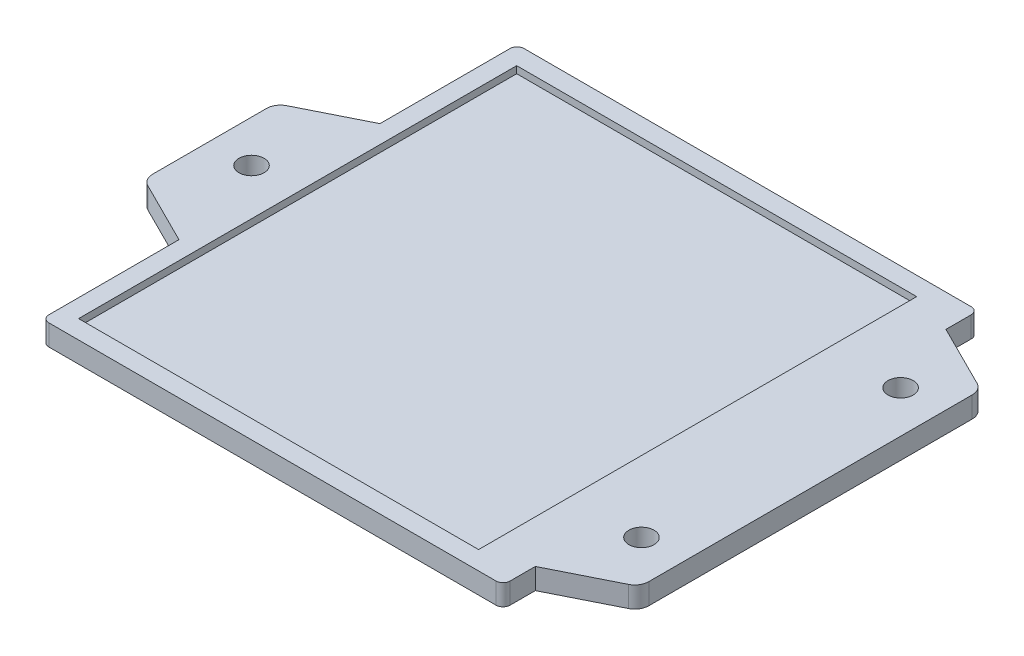
ISO-10303-21;
HEADER;
FILE_DESCRIPTION(('STEP AP214'),'2;1');
FILE_NAME('part.step','',(''),(''),'','','');
FILE_SCHEMA(('AUTOMOTIVE_DESIGN { 1 0 10303 214 1 1 1 1 }'));
ENDSEC;
DATA;
#1=APPLICATION_CONTEXT('core data for automotive mechanical design processes');
#2=APPLICATION_PROTOCOL_DEFINITION('international standard','automotive_design',2000,#1);
#3=PRODUCT_CONTEXT('',#1,'mechanical');
#4=PRODUCT('Part','Part','',(#3));
#5=PRODUCT_RELATED_PRODUCT_CATEGORY('part','',(#4));
#6=PRODUCT_DEFINITION_FORMATION('','',#4);
#7=PRODUCT_DEFINITION_CONTEXT('part definition',#1,'design');
#8=PRODUCT_DEFINITION('design','',#6,#7);
#9=PRODUCT_DEFINITION_SHAPE('','',#8);
#10=(LENGTH_UNIT() NAMED_UNIT(*) SI_UNIT(.MILLI.,.METRE.));
#11=(NAMED_UNIT(*) PLANE_ANGLE_UNIT() SI_UNIT($,.RADIAN.));
#12=(NAMED_UNIT(*) SI_UNIT($,.STERADIAN.) SOLID_ANGLE_UNIT());
#13=UNCERTAINTY_MEASURE_WITH_UNIT(LENGTH_MEASURE(1.E-05),#10,'distance_accuracy_value','');
#14=(GEOMETRIC_REPRESENTATION_CONTEXT(3) GLOBAL_UNCERTAINTY_ASSIGNED_CONTEXT((#13)) GLOBAL_UNIT_ASSIGNED_CONTEXT((#10,
#11,#12)) REPRESENTATION_CONTEXT('',''));
#15=CARTESIAN_POINT('',(0.,0.,0.));
#16=DIRECTION('',(0.,0.,1.));
#17=DIRECTION('',(1.,0.,0.));
#18=AXIS2_PLACEMENT_3D('',#15,#16,#17);
#19=CARTESIAN_POINT('',(32.,3.,33.));
#20=DIRECTION('',(0.,-1.,0.));
#21=DIRECTION('',(0.,0.,-1.));
#22=AXIS2_PLACEMENT_3D('',#19,#20,#21);
#23=PLANE('',#22);
#24=DIRECTION('',(-1.,0.,0.));
#25=VECTOR('',#24,1.);
#26=CARTESIAN_POINT('',(32.,3.,-31.35));
#27=LINE('',#26,#25);
#28=CARTESIAN_POINT('',(26.85,3.,-31.35));
#29=VERTEX_POINT('',#28);
#30=CARTESIAN_POINT('',(-30.4,3.,-31.35));
#31=VERTEX_POINT('',#30);
#32=EDGE_CURVE('E401',#29,#31,#27,.T.);
#33=ORIENTED_EDGE('',*,*,#32,.F.);
#34=DIRECTION('',(0.,0.,-1.));
#35=VECTOR('',#34,1.);
#36=CARTESIAN_POINT('',(26.85,3.,33.));
#37=LINE('',#36,#35);
#38=CARTESIAN_POINT('',(26.85,3.,31.35));
#39=VERTEX_POINT('',#38);
#40=EDGE_CURVE('E48',#39,#29,#37,.T.);
#41=ORIENTED_EDGE('',*,*,#40,.F.);
#42=DIRECTION('',(1.,0.,0.));
#43=VECTOR('',#42,1.);
#44=CARTESIAN_POINT('',(32.,3.,31.35));
#45=LINE('',#44,#43);
#46=CARTESIAN_POINT('',(-30.4,3.,31.35));
#47=VERTEX_POINT('',#46);
#48=EDGE_CURVE('E394',#47,#39,#45,.T.);
#49=ORIENTED_EDGE('',*,*,#48,.F.);
#50=DIRECTION('',(0.,0.,1.));
#51=VECTOR('',#50,1.);
#52=CARTESIAN_POINT('',(-30.4,3.,33.));
#53=LINE('',#52,#51);
#54=EDGE_CURVE('E398',#31,#47,#53,.T.);
#55=ORIENTED_EDGE('',*,*,#54,.F.);
#56=EDGE_LOOP('',(#33,#41,#49,#55));
#57=FACE_BOUND('',#56,.T.);
#58=DIRECTION('',(0.894427190999915,0.,-0.447213595499961));
#59=VECTOR('',#58,1.);
#60=CARTESIAN_POINT('',(41.8944271909999,3.,24.9347524157501));
#61=LINE('',#60,#59);
#62=CARTESIAN_POINT('',(33.,3.,29.3819660112501));
#63=VERTEX_POINT('',#62);
#64=CARTESIAN_POINT('',(41.8944271909999,3.,24.9347524157501));
#65=VERTEX_POINT('',#64);
#66=EDGE_CURVE('E254',#63,#65,#61,.T.);
#67=ORIENTED_EDGE('',*,*,#66,.T.);
#68=CARTESIAN_POINT('',(41.,3.,23.1458980337503));
#69=DIRECTION('',(0.,1.,0.));
#70=DIRECTION('',(0.,0.,-1.));
#71=AXIS2_PLACEMENT_3D('',#68,#69,#70);
#72=CIRCLE('',#71,2.);
#73=CARTESIAN_POINT('',(43.,3.,23.1458980337503));
#74=VERTEX_POINT('',#73);
#75=EDGE_CURVE('E134',#65,#74,#72,.T.);
#76=ORIENTED_EDGE('',*,*,#75,.T.);
#77=DIRECTION('',(0.,0.,-1.));
#78=VECTOR('',#77,1.);
#79=CARTESIAN_POINT('',(43.,3.,-23.1458980337503));
#80=LINE('',#79,#78);
#81=CARTESIAN_POINT('',(43.,3.,-23.1458980337503));
#82=VERTEX_POINT('',#81);
#83=EDGE_CURVE('E305',#74,#82,#80,.T.);
#84=ORIENTED_EDGE('',*,*,#83,.T.);
#85=CARTESIAN_POINT('',(41.,3.,-23.1458980337503));
#86=DIRECTION('',(0.,1.,0.));
#87=DIRECTION('',(0.,0.,-1.));
#88=AXIS2_PLACEMENT_3D('',#85,#86,#87);
#89=CIRCLE('',#88,2.);
#90=CARTESIAN_POINT('',(41.8944271909999,3.,-24.9347524157501));
#91=VERTEX_POINT('',#90);
#92=EDGE_CURVE('E324',#82,#91,#89,.T.);
#93=ORIENTED_EDGE('',*,*,#92,.T.);
#94=DIRECTION('',(-0.894427190999915,0.,-0.44721359549996));
#95=VECTOR('',#94,1.);
#96=CARTESIAN_POINT('',(33.,3.,-29.3819660112501));
#97=LINE('',#96,#95);
#98=CARTESIAN_POINT('',(33.,3.,-29.3819660112501));
#99=VERTEX_POINT('',#98);
#100=EDGE_CURVE('E321',#91,#99,#97,.T.);
#101=ORIENTED_EDGE('',*,*,#100,.T.);
#102=DIRECTION('',(0.,0.,-1.));
#103=VECTOR('',#102,1.);
#104=CARTESIAN_POINT('',(33.,3.,-33.));
#105=LINE('',#104,#103);
#106=CARTESIAN_POINT('',(33.,3.,-33.));
#107=VERTEX_POINT('',#106);
#108=EDGE_CURVE('E323',#99,#107,#105,.T.);
#109=ORIENTED_EDGE('',*,*,#108,.T.);
#110=CARTESIAN_POINT('',(32.,3.,-33.));
#111=DIRECTION('',(0.,1.,0.));
#112=DIRECTION('',(0.,0.,-1.));
#113=AXIS2_PLACEMENT_3D('',#110,#111,#112);
#114=CIRCLE('',#113,1.);
#115=CARTESIAN_POINT('',(32.,3.,-34.));
#116=VERTEX_POINT('',#115);
#117=EDGE_CURVE('E326',#107,#116,#114,.T.);
#118=ORIENTED_EDGE('',*,*,#117,.T.);
#119=DIRECTION('',(-1.,0.,0.));
#120=VECTOR('',#119,1.);
#121=CARTESIAN_POINT('',(-32.,3.,-34.));
#122=LINE('',#121,#120);
#123=CARTESIAN_POINT('',(-32.,3.,-34.));
#124=VERTEX_POINT('',#123);
#125=EDGE_CURVE('E332',#116,#124,#122,.T.);
#126=ORIENTED_EDGE('',*,*,#125,.T.);
#127=CARTESIAN_POINT('',(-32.,3.,-33.));
#128=DIRECTION('',(0.,1.,0.));
#129=DIRECTION('',(0.,0.,-1.));
#130=AXIS2_PLACEMENT_3D('',#127,#128,#129);
#131=CIRCLE('',#130,1.);
#132=CARTESIAN_POINT('',(-33.,3.,-33.));
#133=VERTEX_POINT('',#132);
#134=EDGE_CURVE('E334',#124,#133,#131,.T.);
#135=ORIENTED_EDGE('',*,*,#134,.T.);
#136=DIRECTION('',(0.,0.,1.));
#137=VECTOR('',#136,1.);
#138=CARTESIAN_POINT('',(-33.,3.,-14.3819660112501));
#139=LINE('',#138,#137);
#140=CARTESIAN_POINT('',(-33.,3.,-14.3819660112501));
#141=VERTEX_POINT('',#140);
#142=EDGE_CURVE('E336',#133,#141,#139,.T.);
#143=ORIENTED_EDGE('',*,*,#142,.T.);
#144=DIRECTION('',(-0.894427190999916,0.,0.447213595499959));
#145=VECTOR('',#144,1.);
#146=CARTESIAN_POINT('',(-41.8944271909999,3.,-9.93475241575016));
#147=LINE('',#146,#145);
#148=CARTESIAN_POINT('',(-41.8944271909999,3.,-9.93475241575016));
#149=VERTEX_POINT('',#148);
#150=EDGE_CURVE('E338',#141,#149,#147,.T.);
#151=ORIENTED_EDGE('',*,*,#150,.T.);
#152=CARTESIAN_POINT('',(-41.,3.,-8.14589803375033));
#153=DIRECTION('',(0.,1.,0.));
#154=DIRECTION('',(0.,0.,-1.));
#155=AXIS2_PLACEMENT_3D('',#152,#153,#154);
#156=CIRCLE('',#155,2.);
#157=CARTESIAN_POINT('',(-43.,3.,-8.14589803375032));
#158=VERTEX_POINT('',#157);
#159=EDGE_CURVE('E340',#149,#158,#156,.T.);
#160=ORIENTED_EDGE('',*,*,#159,.T.);
#161=DIRECTION('',(0.,0.,1.));
#162=VECTOR('',#161,1.);
#163=CARTESIAN_POINT('',(-43.,3.,8.14589803375031));
#164=LINE('',#163,#162);
#165=CARTESIAN_POINT('',(-43.,3.,8.14589803375031));
#166=VERTEX_POINT('',#165);
#167=EDGE_CURVE('E342',#158,#166,#164,.T.);
#168=ORIENTED_EDGE('',*,*,#167,.T.);
#169=CARTESIAN_POINT('',(-41.,3.,8.14589803375032));
#170=DIRECTION('',(0.,1.,0.));
#171=DIRECTION('',(0.,0.,-1.));
#172=AXIS2_PLACEMENT_3D('',#169,#170,#171);
#173=CIRCLE('',#172,2.);
#174=CARTESIAN_POINT('',(-41.8944271909999,3.,9.93475241575016));
#175=VERTEX_POINT('',#174);
#176=EDGE_CURVE('E344',#166,#175,#173,.T.);
#177=ORIENTED_EDGE('',*,*,#176,.T.);
#178=DIRECTION('',(0.894427190999915,0.,0.447213595499959));
#179=VECTOR('',#178,1.);
#180=CARTESIAN_POINT('',(-33.,3.,14.3819660112501));
#181=LINE('',#180,#179);
#182=CARTESIAN_POINT('',(-33.,3.,14.3819660112501));
#183=VERTEX_POINT('',#182);
#184=EDGE_CURVE('E346',#175,#183,#181,.T.);
#185=ORIENTED_EDGE('',*,*,#184,.T.);
#186=DIRECTION('',(0.,0.,1.));
#187=VECTOR('',#186,1.);
#188=CARTESIAN_POINT('',(-33.,3.,33.));
#189=LINE('',#188,#187);
#190=CARTESIAN_POINT('',(-33.,3.,33.));
#191=VERTEX_POINT('',#190);
#192=EDGE_CURVE('E348',#183,#191,#189,.T.);
#193=ORIENTED_EDGE('',*,*,#192,.T.);
#194=CARTESIAN_POINT('',(-32.,3.,33.));
#195=DIRECTION('',(0.,1.,0.));
#196=DIRECTION('',(0.,0.,-1.));
#197=AXIS2_PLACEMENT_3D('',#194,#195,#196);
#198=CIRCLE('',#197,1.);
#199=CARTESIAN_POINT('',(-32.,3.,34.));
#200=VERTEX_POINT('',#199);
#201=EDGE_CURVE('E193',#191,#200,#198,.T.);
#202=ORIENTED_EDGE('',*,*,#201,.T.);
#203=DIRECTION('',(1.,0.,0.));
#204=VECTOR('',#203,1.);
#205=CARTESIAN_POINT('',(32.,3.,34.));
#206=LINE('',#205,#204);
#207=CARTESIAN_POINT('',(32.,3.,34.));
#208=VERTEX_POINT('',#207);
#209=EDGE_CURVE('E186',#200,#208,#206,.T.);
#210=ORIENTED_EDGE('',*,*,#209,.T.);
#211=CARTESIAN_POINT('',(32.,3.,33.));
#212=DIRECTION('',(0.,1.,0.));
#213=DIRECTION('',(0.,0.,-1.));
#214=AXIS2_PLACEMENT_3D('',#211,#212,#213);
#215=CIRCLE('',#214,1.);
#216=CARTESIAN_POINT('',(33.,3.,33.));
#217=VERTEX_POINT('',#216);
#218=EDGE_CURVE('E190',#208,#217,#215,.T.);
#219=ORIENTED_EDGE('',*,*,#218,.T.);
#220=DIRECTION('',(0.,0.,-1.));
#221=VECTOR('',#220,1.);
#222=CARTESIAN_POINT('',(33.,3.,29.3819660112501));
#223=LINE('',#222,#221);
#224=EDGE_CURVE('E57',#217,#63,#223,.T.);
#225=ORIENTED_EDGE('',*,*,#224,.T.);
#226=EDGE_LOOP('',(#67,#76,#84,#93,#101,#109,#118,#126,#135,#143,#151,#160,#168,#177,#185,#193,
#202,#210,#219,#225));
#227=FACE_BOUND('',#226,.T.);
#228=CARTESIAN_POINT('',(37.,3.,18.1929063793597));
#229=DIRECTION('',(0.,1.,0.));
#230=DIRECTION('',(0.,0.,1.));
#231=AXIS2_PLACEMENT_3D('',#228,#229,#230);
#232=CIRCLE('',#231,1.79999999999999);
#233=CARTESIAN_POINT('',(37.,3.,19.9929063793596));
#234=VERTEX_POINT('',#233);
#235=EDGE_CURVE('E218',#234,#234,#232,.T.);
#236=ORIENTED_EDGE('',*,*,#235,.F.);
#237=EDGE_LOOP('',(#236));
#238=FACE_BOUND('',#237,.T.);
#239=CARTESIAN_POINT('',(37.,3.,-18.8964134745486));
#240=DIRECTION('',(0.,1.,0.));
#241=DIRECTION('',(0.,0.,1.));
#242=AXIS2_PLACEMENT_3D('',#239,#240,#241);
#243=CIRCLE('',#242,1.8);
#244=CARTESIAN_POINT('',(37.,3.,-17.0964134745486));
#245=VERTEX_POINT('',#244);
#246=EDGE_CURVE('E369',#245,#245,#243,.T.);
#247=ORIENTED_EDGE('',*,*,#246,.F.);
#248=EDGE_LOOP('',(#247));
#249=FACE_BOUND('',#248,.T.);
#250=CARTESIAN_POINT('',(-37.,3.,0.));
#251=DIRECTION('',(0.,1.,0.));
#252=DIRECTION('',(0.,0.,1.));
#253=AXIS2_PLACEMENT_3D('',#250,#251,#252);
#254=CIRCLE('',#253,1.8);
#255=CARTESIAN_POINT('',(-37.,3.,1.8));
#256=VERTEX_POINT('',#255);
#257=EDGE_CURVE('E375',#256,#256,#254,.T.);
#258=ORIENTED_EDGE('',*,*,#257,.F.);
#259=EDGE_LOOP('',(#258));
#260=FACE_BOUND('',#259,.T.);
#261=ADVANCED_FACE('F33',(#57,#227,#238,#249,#260),#23,.F.);
#262=CARTESIAN_POINT('',(32.,0.,33.));
#263=DIRECTION('',(0.,-1.,0.));
#264=DIRECTION('',(0.,0.,-1.));
#265=AXIS2_PLACEMENT_3D('',#262,#263,#264);
#266=PLANE('',#265);
#267=CARTESIAN_POINT('',(37.,0.,-18.8964134745486));
#268=DIRECTION('',(0.,1.,0.));
#269=DIRECTION('',(0.,0.,1.));
#270=AXIS2_PLACEMENT_3D('',#267,#268,#269);
#271=CIRCLE('',#270,1.8);
#272=CARTESIAN_POINT('',(37.,0.,-17.0964134745486));
#273=VERTEX_POINT('',#272);
#274=EDGE_CURVE('E372',#273,#273,#271,.T.);
#275=ORIENTED_EDGE('',*,*,#274,.T.);
#276=EDGE_LOOP('',(#275));
#277=FACE_BOUND('',#276,.T.);
#278=DIRECTION('',(0.894427190999915,0.,-0.447213595499961));
#279=VECTOR('',#278,1.);
#280=CARTESIAN_POINT('',(41.8944271909999,0.,24.9347524157501));
#281=LINE('',#280,#279);
#282=CARTESIAN_POINT('',(33.,0.,29.3819660112501));
#283=VERTEX_POINT('',#282);
#284=CARTESIAN_POINT('',(41.8944271909999,0.,24.9347524157501));
#285=VERTEX_POINT('',#284);
#286=EDGE_CURVE('E214',#283,#285,#281,.T.);
#287=ORIENTED_EDGE('',*,*,#286,.F.);
#288=DIRECTION('',(0.,0.,-1.));
#289=VECTOR('',#288,1.);
#290=CARTESIAN_POINT('',(33.,0.,29.3819660112501));
#291=LINE('',#290,#289);
#292=CARTESIAN_POINT('',(33.,0.,33.));
#293=VERTEX_POINT('',#292);
#294=EDGE_CURVE('E126',#293,#283,#291,.T.);
#295=ORIENTED_EDGE('',*,*,#294,.F.);
#296=CARTESIAN_POINT('',(32.,0.,33.));
#297=DIRECTION('',(0.,1.,0.));
#298=DIRECTION('',(0.,0.,-1.));
#299=AXIS2_PLACEMENT_3D('',#296,#297,#298);
#300=CIRCLE('',#299,1.);
#301=CARTESIAN_POINT('',(32.,0.,34.));
#302=VERTEX_POINT('',#301);
#303=EDGE_CURVE('E251',#302,#293,#300,.T.);
#304=ORIENTED_EDGE('',*,*,#303,.F.);
#305=DIRECTION('',(1.,0.,0.));
#306=VECTOR('',#305,1.);
#307=CARTESIAN_POINT('',(32.,0.,34.));
#308=LINE('',#307,#306);
#309=CARTESIAN_POINT('',(-32.,0.,34.));
#310=VERTEX_POINT('',#309);
#311=EDGE_CURVE('E202',#310,#302,#308,.T.);
#312=ORIENTED_EDGE('',*,*,#311,.F.);
#313=CARTESIAN_POINT('',(-32.,0.,33.));
#314=DIRECTION('',(0.,1.,0.));
#315=DIRECTION('',(0.,0.,-1.));
#316=AXIS2_PLACEMENT_3D('',#313,#314,#315);
#317=CIRCLE('',#316,1.);
#318=CARTESIAN_POINT('',(-33.,0.,33.));
#319=VERTEX_POINT('',#318);
#320=EDGE_CURVE('E248',#319,#310,#317,.T.);
#321=ORIENTED_EDGE('',*,*,#320,.F.);
#322=DIRECTION('',(0.,0.,1.));
#323=VECTOR('',#322,1.);
#324=CARTESIAN_POINT('',(-33.,0.,33.));
#325=LINE('',#324,#323);
#326=CARTESIAN_POINT('',(-33.,0.,14.3819660112501));
#327=VERTEX_POINT('',#326);
#328=EDGE_CURVE('E246',#327,#319,#325,.T.);
#329=ORIENTED_EDGE('',*,*,#328,.F.);
#330=DIRECTION('',(0.894427190999915,0.,0.447213595499959));
#331=VECTOR('',#330,1.);
#332=CARTESIAN_POINT('',(-33.,0.,14.3819660112501));
#333=LINE('',#332,#331);
#334=CARTESIAN_POINT('',(-41.8944271909999,0.,9.93475241575016));
#335=VERTEX_POINT('',#334);
#336=EDGE_CURVE('E244',#335,#327,#333,.T.);
#337=ORIENTED_EDGE('',*,*,#336,.F.);
#338=CARTESIAN_POINT('',(-41.,0.,8.14589803375032));
#339=DIRECTION('',(0.,1.,0.));
#340=DIRECTION('',(0.,0.,-1.));
#341=AXIS2_PLACEMENT_3D('',#338,#339,#340);
#342=CIRCLE('',#341,2.);
#343=CARTESIAN_POINT('',(-43.,0.,8.14589803375031));
#344=VERTEX_POINT('',#343);
#345=EDGE_CURVE('E242',#344,#335,#342,.T.);
#346=ORIENTED_EDGE('',*,*,#345,.F.);
#347=DIRECTION('',(0.,0.,1.));
#348=VECTOR('',#347,1.);
#349=CARTESIAN_POINT('',(-43.,0.,8.14589803375031));
#350=LINE('',#349,#348);
#351=CARTESIAN_POINT('',(-43.,0.,-8.14589803375032));
#352=VERTEX_POINT('',#351);
#353=EDGE_CURVE('E240',#352,#344,#350,.T.);
#354=ORIENTED_EDGE('',*,*,#353,.F.);
#355=CARTESIAN_POINT('',(-41.,0.,-8.14589803375033));
#356=DIRECTION('',(0.,1.,0.));
#357=DIRECTION('',(0.,0.,-1.));
#358=AXIS2_PLACEMENT_3D('',#355,#356,#357);
#359=CIRCLE('',#358,2.);
#360=CARTESIAN_POINT('',(-41.8944271909999,0.,-9.93475241575016));
#361=VERTEX_POINT('',#360);
#362=EDGE_CURVE('E238',#361,#352,#359,.T.);
#363=ORIENTED_EDGE('',*,*,#362,.F.);
#364=DIRECTION('',(-0.894427190999916,0.,0.447213595499959));
#365=VECTOR('',#364,1.);
#366=CARTESIAN_POINT('',(-41.8944271909999,0.,-9.93475241575016));
#367=LINE('',#366,#365);
#368=CARTESIAN_POINT('',(-33.,0.,-14.3819660112501));
#369=VERTEX_POINT('',#368);
#370=EDGE_CURVE('E236',#369,#361,#367,.T.);
#371=ORIENTED_EDGE('',*,*,#370,.F.);
#372=DIRECTION('',(0.,0.,1.));
#373=VECTOR('',#372,1.);
#374=CARTESIAN_POINT('',(-33.,0.,-14.3819660112501));
#375=LINE('',#374,#373);
#376=CARTESIAN_POINT('',(-33.,0.,-33.));
#377=VERTEX_POINT('',#376);
#378=EDGE_CURVE('E234',#377,#369,#375,.T.);
#379=ORIENTED_EDGE('',*,*,#378,.F.);
#380=CARTESIAN_POINT('',(-32.,0.,-33.));
#381=DIRECTION('',(0.,1.,0.));
#382=DIRECTION('',(0.,0.,-1.));
#383=AXIS2_PLACEMENT_3D('',#380,#381,#382);
#384=CIRCLE('',#383,1.);
#385=CARTESIAN_POINT('',(-32.,0.,-34.));
#386=VERTEX_POINT('',#385);
#387=EDGE_CURVE('E232',#386,#377,#384,.T.);
#388=ORIENTED_EDGE('',*,*,#387,.F.);
#389=DIRECTION('',(-1.,0.,0.));
#390=VECTOR('',#389,1.);
#391=CARTESIAN_POINT('',(-32.,0.,-34.));
#392=LINE('',#391,#390);
#393=CARTESIAN_POINT('',(32.,0.,-34.));
#394=VERTEX_POINT('',#393);
#395=EDGE_CURVE('E230',#394,#386,#392,.T.);
#396=ORIENTED_EDGE('',*,*,#395,.F.);
#397=CARTESIAN_POINT('',(32.,0.,-33.));
#398=DIRECTION('',(0.,1.,0.));
#399=DIRECTION('',(0.,0.,-1.));
#400=AXIS2_PLACEMENT_3D('',#397,#398,#399);
#401=CIRCLE('',#400,1.);
#402=CARTESIAN_POINT('',(33.,0.,-33.));
#403=VERTEX_POINT('',#402);
#404=EDGE_CURVE('E228',#403,#394,#401,.T.);
#405=ORIENTED_EDGE('',*,*,#404,.F.);
#406=DIRECTION('',(0.,0.,-1.));
#407=VECTOR('',#406,1.);
#408=CARTESIAN_POINT('',(33.,0.,-33.));
#409=LINE('',#408,#407);
#410=CARTESIAN_POINT('',(33.,0.,-29.3819660112501));
#411=VERTEX_POINT('',#410);
#412=EDGE_CURVE('E226',#411,#403,#409,.T.);
#413=ORIENTED_EDGE('',*,*,#412,.F.);
#414=DIRECTION('',(-0.894427190999915,0.,-0.44721359549996));
#415=VECTOR('',#414,1.);
#416=CARTESIAN_POINT('',(33.,0.,-29.3819660112501));
#417=LINE('',#416,#415);
#418=CARTESIAN_POINT('',(41.8944271909999,0.,-24.9347524157501));
#419=VERTEX_POINT('',#418);
#420=EDGE_CURVE('E224',#419,#411,#417,.T.);
#421=ORIENTED_EDGE('',*,*,#420,.F.);
#422=CARTESIAN_POINT('',(41.,0.,-23.1458980337503));
#423=DIRECTION('',(0.,1.,0.));
#424=DIRECTION('',(0.,0.,-1.));
#425=AXIS2_PLACEMENT_3D('',#422,#423,#424);
#426=CIRCLE('',#425,2.);
#427=CARTESIAN_POINT('',(43.,0.,-23.1458980337503));
#428=VERTEX_POINT('',#427);
#429=EDGE_CURVE('E222',#428,#419,#426,.T.);
#430=ORIENTED_EDGE('',*,*,#429,.F.);
#431=DIRECTION('',(0.,0.,-1.));
#432=VECTOR('',#431,1.);
#433=CARTESIAN_POINT('',(43.,0.,-23.1458980337503));
#434=LINE('',#433,#432);
#435=CARTESIAN_POINT('',(43.,0.,23.1458980337503));
#436=VERTEX_POINT('',#435);
#437=EDGE_CURVE('E220',#436,#428,#434,.T.);
#438=ORIENTED_EDGE('',*,*,#437,.F.);
#439=CARTESIAN_POINT('',(41.,0.,23.1458980337503));
#440=DIRECTION('',(0.,1.,0.));
#441=DIRECTION('',(0.,0.,-1.));
#442=AXIS2_PLACEMENT_3D('',#439,#440,#441);
#443=CIRCLE('',#442,2.);
#444=EDGE_CURVE('E217',#285,#436,#443,.T.);
#445=ORIENTED_EDGE('',*,*,#444,.F.);
#446=EDGE_LOOP('',(#287,#295,#304,#312,#321,#329,#337,#346,#354,#363,#371,#379,#388,#396,#405,
#413,#421,#430,#438,#445));
#447=FACE_BOUND('',#446,.T.);
#448=CARTESIAN_POINT('',(37.,0.,18.1929063793597));
#449=DIRECTION('',(0.,1.,0.));
#450=DIRECTION('',(0.,0.,1.));
#451=AXIS2_PLACEMENT_3D('',#448,#449,#450);
#452=CIRCLE('',#451,1.79999999999999);
#453=CARTESIAN_POINT('',(37.,0.,19.9929063793596));
#454=VERTEX_POINT('',#453);
#455=EDGE_CURVE('E366',#454,#454,#452,.T.);
#456=ORIENTED_EDGE('',*,*,#455,.T.);
#457=EDGE_LOOP('',(#456));
#458=FACE_BOUND('',#457,.T.);
#459=CARTESIAN_POINT('',(-37.,0.,0.));
#460=DIRECTION('',(0.,1.,0.));
#461=DIRECTION('',(0.,0.,1.));
#462=AXIS2_PLACEMENT_3D('',#459,#460,#461);
#463=CIRCLE('',#462,1.8);
#464=CARTESIAN_POINT('',(-37.,0.,1.8));
#465=VERTEX_POINT('',#464);
#466=EDGE_CURVE('E378',#465,#465,#463,.T.);
#467=ORIENTED_EDGE('',*,*,#466,.T.);
#468=EDGE_LOOP('',(#467));
#469=FACE_BOUND('',#468,.T.);
#470=ADVANCED_FACE('F309',(#277,#447,#458,#469),#266,.T.);
#471=CARTESIAN_POINT('',(41.8944271909999,3.,24.9347524157501));
#472=DIRECTION('',(-0.447213595499961,0.,-0.894427190999914));
#473=DIRECTION('',(-0.894427190999915,0.,0.447213595499961));
#474=AXIS2_PLACEMENT_3D('',#471,#472,#473);
#475=PLANE('',#474);
#476=ORIENTED_EDGE('',*,*,#286,.T.);
#477=DIRECTION('',(0.,-1.,0.));
#478=VECTOR('',#477,1.);
#479=CARTESIAN_POINT('',(41.8944271909999,3.,24.9347524157501));
#480=LINE('',#479,#478);
#481=EDGE_CURVE('E11',#65,#285,#480,.T.);
#482=ORIENTED_EDGE('',*,*,#481,.F.);
#483=ORIENTED_EDGE('',*,*,#66,.F.);
#484=DIRECTION('',(0.,-1.,0.));
#485=VECTOR('',#484,1.);
#486=CARTESIAN_POINT('',(33.,3.,29.3819660112501));
#487=LINE('',#486,#485);
#488=EDGE_CURVE('E210',#63,#283,#487,.T.);
#489=ORIENTED_EDGE('',*,*,#488,.T.);
#490=EDGE_LOOP('',(#476,#482,#483,#489));
#491=FACE_BOUND('',#490,.T.);
#492=ADVANCED_FACE('F35',(#491),#475,.F.);
#493=CARTESIAN_POINT('',(41.,3.,23.1458980337503));
#494=DIRECTION('',(0.,-1.,0.));
#495=DIRECTION('',(0.,0.,-1.));
#496=AXIS2_PLACEMENT_3D('',#493,#494,#495);
#497=CYLINDRICAL_SURFACE('',#496,2.);
#498=ORIENTED_EDGE('',*,*,#444,.T.);
#499=DIRECTION('',(0.,-1.,0.));
#500=VECTOR('',#499,1.);
#501=CARTESIAN_POINT('',(43.,3.,23.1458980337503));
#502=LINE('',#501,#500);
#503=EDGE_CURVE('E41',#74,#436,#502,.T.);
#504=ORIENTED_EDGE('',*,*,#503,.F.);
#505=ORIENTED_EDGE('',*,*,#75,.F.);
#506=ORIENTED_EDGE('',*,*,#481,.T.);
#507=EDGE_LOOP('',(#498,#504,#505,#506));
#508=FACE_BOUND('',#507,.T.);
#509=ADVANCED_FACE('F519',(#508),#497,.T.);
#510=CARTESIAN_POINT('',(43.,3.,-23.1458980337503));
#511=DIRECTION('',(-1.,0.,0.));
#512=DIRECTION('',(0.,0.,1.));
#513=AXIS2_PLACEMENT_3D('',#510,#511,#512);
#514=PLANE('',#513);
#515=ORIENTED_EDGE('',*,*,#437,.T.);
#516=DIRECTION('',(0.,-1.,0.));
#517=VECTOR('',#516,1.);
#518=CARTESIAN_POINT('',(43.,3.,-23.1458980337503));
#519=LINE('',#518,#517);
#520=EDGE_CURVE('E297',#82,#428,#519,.T.);
#521=ORIENTED_EDGE('',*,*,#520,.F.);
#522=ORIENTED_EDGE('',*,*,#83,.F.);
#523=ORIENTED_EDGE('',*,*,#503,.T.);
#524=EDGE_LOOP('',(#515,#521,#522,#523));
#525=FACE_BOUND('',#524,.T.);
#526=ADVANCED_FACE('F303',(#525),#514,.F.);
#527=CARTESIAN_POINT('',(41.,3.,-23.1458980337503));
#528=DIRECTION('',(0.,-1.,0.));
#529=DIRECTION('',(0.,0.,-1.));
#530=AXIS2_PLACEMENT_3D('',#527,#528,#529);
#531=CYLINDRICAL_SURFACE('',#530,2.);
#532=ORIENTED_EDGE('',*,*,#429,.T.);
#533=DIRECTION('',(0.,-1.,0.));
#534=VECTOR('',#533,1.);
#535=CARTESIAN_POINT('',(41.8944271909999,3.,-24.9347524157501));
#536=LINE('',#535,#534);
#537=EDGE_CURVE('E294',#91,#419,#536,.T.);
#538=ORIENTED_EDGE('',*,*,#537,.F.);
#539=ORIENTED_EDGE('',*,*,#92,.F.);
#540=ORIENTED_EDGE('',*,*,#520,.T.);
#541=EDGE_LOOP('',(#532,#538,#539,#540));
#542=FACE_BOUND('',#541,.T.);
#543=ADVANCED_FACE('F315',(#542),#531,.T.);
#544=CARTESIAN_POINT('',(33.,3.,-29.3819660112501));
#545=DIRECTION('',(-0.44721359549996,0.,0.894427190999915));
#546=DIRECTION('',(0.894427190999915,0.,0.44721359549996));
#547=AXIS2_PLACEMENT_3D('',#544,#545,#546);
#548=PLANE('',#547);
#549=ORIENTED_EDGE('',*,*,#420,.T.);
#550=DIRECTION('',(0.,-1.,0.));
#551=VECTOR('',#550,1.);
#552=CARTESIAN_POINT('',(33.,3.,-29.3819660112501));
#553=LINE('',#552,#551);
#554=EDGE_CURVE('E291',#99,#411,#553,.T.);
#555=ORIENTED_EDGE('',*,*,#554,.F.);
#556=ORIENTED_EDGE('',*,*,#100,.F.);
#557=ORIENTED_EDGE('',*,*,#537,.T.);
#558=EDGE_LOOP('',(#549,#555,#556,#557));
#559=FACE_BOUND('',#558,.T.);
#560=ADVANCED_FACE('F319',(#559),#548,.F.);
#561=CARTESIAN_POINT('',(33.,3.,-33.));
#562=DIRECTION('',(-1.,0.,0.));
#563=DIRECTION('',(0.,0.,1.));
#564=AXIS2_PLACEMENT_3D('',#561,#562,#563);
#565=PLANE('',#564);
#566=ORIENTED_EDGE('',*,*,#412,.T.);
#567=DIRECTION('',(0.,-1.,0.));
#568=VECTOR('',#567,1.);
#569=CARTESIAN_POINT('',(33.,3.,-33.));
#570=LINE('',#569,#568);
#571=EDGE_CURVE('E288',#107,#403,#570,.T.);
#572=ORIENTED_EDGE('',*,*,#571,.F.);
#573=ORIENTED_EDGE('',*,*,#108,.F.);
#574=ORIENTED_EDGE('',*,*,#554,.T.);
#575=EDGE_LOOP('',(#566,#572,#573,#574));
#576=FACE_BOUND('',#575,.T.);
#577=ADVANCED_FACE('F509',(#576),#565,.F.);
#578=CARTESIAN_POINT('',(32.,3.,-33.));
#579=DIRECTION('',(0.,-1.,0.));
#580=DIRECTION('',(0.,0.,-1.));
#581=AXIS2_PLACEMENT_3D('',#578,#579,#580);
#582=CYLINDRICAL_SURFACE('',#581,1.);
#583=ORIENTED_EDGE('',*,*,#404,.T.);
#584=DIRECTION('',(0.,-1.,0.));
#585=VECTOR('',#584,1.);
#586=CARTESIAN_POINT('',(32.,3.,-34.));
#587=LINE('',#586,#585);
#588=EDGE_CURVE('E285',#116,#394,#587,.T.);
#589=ORIENTED_EDGE('',*,*,#588,.F.);
#590=ORIENTED_EDGE('',*,*,#117,.F.);
#591=ORIENTED_EDGE('',*,*,#571,.T.);
#592=EDGE_LOOP('',(#583,#589,#590,#591));
#593=FACE_BOUND('',#592,.T.);
#594=ADVANCED_FACE('F505',(#593),#582,.T.);
#595=CARTESIAN_POINT('',(-32.,3.,-34.));
#596=DIRECTION('',(0.,0.,1.));
#597=DIRECTION('',(1.,0.,0.));
#598=AXIS2_PLACEMENT_3D('',#595,#596,#597);
#599=PLANE('',#598);
#600=ORIENTED_EDGE('',*,*,#395,.T.);
#601=DIRECTION('',(0.,-1.,0.));
#602=VECTOR('',#601,1.);
#603=CARTESIAN_POINT('',(-32.,3.,-34.));
#604=LINE('',#603,#602);
#605=EDGE_CURVE('E282',#124,#386,#604,.T.);
#606=ORIENTED_EDGE('',*,*,#605,.F.);
#607=ORIENTED_EDGE('',*,*,#125,.F.);
#608=ORIENTED_EDGE('',*,*,#588,.T.);
#609=EDGE_LOOP('',(#600,#606,#607,#608));
#610=FACE_BOUND('',#609,.T.);
#611=ADVANCED_FACE('F501',(#610),#599,.F.);
#612=CARTESIAN_POINT('',(-32.,3.,-33.));
#613=DIRECTION('',(0.,-1.,0.));
#614=DIRECTION('',(0.,0.,-1.));
#615=AXIS2_PLACEMENT_3D('',#612,#613,#614);
#616=CYLINDRICAL_SURFACE('',#615,1.);
#617=ORIENTED_EDGE('',*,*,#387,.T.);
#618=DIRECTION('',(0.,-1.,0.));
#619=VECTOR('',#618,1.);
#620=CARTESIAN_POINT('',(-33.,3.,-33.));
#621=LINE('',#620,#619);
#622=EDGE_CURVE('E279',#133,#377,#621,.T.);
#623=ORIENTED_EDGE('',*,*,#622,.F.);
#624=ORIENTED_EDGE('',*,*,#134,.F.);
#625=ORIENTED_EDGE('',*,*,#605,.T.);
#626=EDGE_LOOP('',(#617,#623,#624,#625));
#627=FACE_BOUND('',#626,.T.);
#628=ADVANCED_FACE('F497',(#627),#616,.T.);
#629=CARTESIAN_POINT('',(-33.,3.,-14.3819660112501));
#630=DIRECTION('',(1.,0.,0.));
#631=DIRECTION('',(0.,0.,-1.));
#632=AXIS2_PLACEMENT_3D('',#629,#630,#631);
#633=PLANE('',#632);
#634=ORIENTED_EDGE('',*,*,#378,.T.);
#635=DIRECTION('',(0.,-1.,0.));
#636=VECTOR('',#635,1.);
#637=CARTESIAN_POINT('',(-33.,3.,-14.3819660112501));
#638=LINE('',#637,#636);
#639=EDGE_CURVE('E276',#141,#369,#638,.T.);
#640=ORIENTED_EDGE('',*,*,#639,.F.);
#641=ORIENTED_EDGE('',*,*,#142,.F.);
#642=ORIENTED_EDGE('',*,*,#622,.T.);
#643=EDGE_LOOP('',(#634,#640,#641,#642));
#644=FACE_BOUND('',#643,.T.);
#645=ADVANCED_FACE('F493',(#644),#633,.F.);
#646=CARTESIAN_POINT('',(-41.8944271909999,3.,-9.93475241575016));
#647=DIRECTION('',(0.447213595499959,0.,0.894427190999916));
#648=DIRECTION('',(0.894427190999916,0.,-0.447213595499959));
#649=AXIS2_PLACEMENT_3D('',#646,#647,#648);
#650=PLANE('',#649);
#651=ORIENTED_EDGE('',*,*,#370,.T.);
#652=DIRECTION('',(0.,-1.,0.));
#653=VECTOR('',#652,1.);
#654=CARTESIAN_POINT('',(-41.8944271909999,3.,-9.93475241575016));
#655=LINE('',#654,#653);
#656=EDGE_CURVE('E273',#149,#361,#655,.T.);
#657=ORIENTED_EDGE('',*,*,#656,.F.);
#658=ORIENTED_EDGE('',*,*,#150,.F.);
#659=ORIENTED_EDGE('',*,*,#639,.T.);
#660=EDGE_LOOP('',(#651,#657,#658,#659));
#661=FACE_BOUND('',#660,.T.);
#662=ADVANCED_FACE('F489',(#661),#650,.F.);
#663=CARTESIAN_POINT('',(-41.,3.,-8.14589803375033));
#664=DIRECTION('',(0.,-1.,0.));
#665=DIRECTION('',(0.,0.,-1.));
#666=AXIS2_PLACEMENT_3D('',#663,#664,#665);
#667=CYLINDRICAL_SURFACE('',#666,2.);
#668=ORIENTED_EDGE('',*,*,#362,.T.);
#669=DIRECTION('',(0.,-1.,0.));
#670=VECTOR('',#669,1.);
#671=CARTESIAN_POINT('',(-43.,3.,-8.14589803375032));
#672=LINE('',#671,#670);
#673=EDGE_CURVE('E270',#158,#352,#672,.T.);
#674=ORIENTED_EDGE('',*,*,#673,.F.);
#675=ORIENTED_EDGE('',*,*,#159,.F.);
#676=ORIENTED_EDGE('',*,*,#656,.T.);
#677=EDGE_LOOP('',(#668,#674,#675,#676));
#678=FACE_BOUND('',#677,.T.);
#679=ADVANCED_FACE('F485',(#678),#667,.T.);
#680=CARTESIAN_POINT('',(-43.,3.,8.14589803375031));
#681=DIRECTION('',(1.,0.,0.));
#682=DIRECTION('',(0.,0.,-1.));
#683=AXIS2_PLACEMENT_3D('',#680,#681,#682);
#684=PLANE('',#683);
#685=ORIENTED_EDGE('',*,*,#353,.T.);
#686=DIRECTION('',(0.,-1.,0.));
#687=VECTOR('',#686,1.);
#688=CARTESIAN_POINT('',(-43.,3.,8.14589803375031));
#689=LINE('',#688,#687);
#690=EDGE_CURVE('E267',#166,#344,#689,.T.);
#691=ORIENTED_EDGE('',*,*,#690,.F.);
#692=ORIENTED_EDGE('',*,*,#167,.F.);
#693=ORIENTED_EDGE('',*,*,#673,.T.);
#694=EDGE_LOOP('',(#685,#691,#692,#693));
#695=FACE_BOUND('',#694,.T.);
#696=ADVANCED_FACE('F481',(#695),#684,.F.);
#697=CARTESIAN_POINT('',(-41.,3.,8.14589803375032));
#698=DIRECTION('',(0.,-1.,0.));
#699=DIRECTION('',(0.,0.,-1.));
#700=AXIS2_PLACEMENT_3D('',#697,#698,#699);
#701=CYLINDRICAL_SURFACE('',#700,2.);
#702=ORIENTED_EDGE('',*,*,#345,.T.);
#703=DIRECTION('',(0.,-1.,0.));
#704=VECTOR('',#703,1.);
#705=CARTESIAN_POINT('',(-41.8944271909999,3.,9.93475241575016));
#706=LINE('',#705,#704);
#707=EDGE_CURVE('E264',#175,#335,#706,.T.);
#708=ORIENTED_EDGE('',*,*,#707,.F.);
#709=ORIENTED_EDGE('',*,*,#176,.F.);
#710=ORIENTED_EDGE('',*,*,#690,.T.);
#711=EDGE_LOOP('',(#702,#708,#709,#710));
#712=FACE_BOUND('',#711,.T.);
#713=ADVANCED_FACE('F477',(#712),#701,.T.);
#714=CARTESIAN_POINT('',(-33.,3.,14.3819660112501));
#715=DIRECTION('',(0.447213595499959,0.,-0.894427190999915));
#716=DIRECTION('',(-0.894427190999916,0.,-0.447213595499959));
#717=AXIS2_PLACEMENT_3D('',#714,#715,#716);
#718=PLANE('',#717);
#719=ORIENTED_EDGE('',*,*,#336,.T.);
#720=DIRECTION('',(0.,-1.,0.));
#721=VECTOR('',#720,1.);
#722=CARTESIAN_POINT('',(-33.,3.,14.3819660112501));
#723=LINE('',#722,#721);
#724=EDGE_CURVE('E261',#183,#327,#723,.T.);
#725=ORIENTED_EDGE('',*,*,#724,.F.);
#726=ORIENTED_EDGE('',*,*,#184,.F.);
#727=ORIENTED_EDGE('',*,*,#707,.T.);
#728=EDGE_LOOP('',(#719,#725,#726,#727));
#729=FACE_BOUND('',#728,.T.);
#730=ADVANCED_FACE('F474',(#729),#718,.F.);
#731=CARTESIAN_POINT('',(-33.,3.,33.));
#732=DIRECTION('',(1.,0.,0.));
#733=DIRECTION('',(0.,0.,-1.));
#734=AXIS2_PLACEMENT_3D('',#731,#732,#733);
#735=PLANE('',#734);
#736=ORIENTED_EDGE('',*,*,#328,.T.);
#737=DIRECTION('',(0.,-1.,0.));
#738=VECTOR('',#737,1.);
#739=CARTESIAN_POINT('',(-33.,3.,33.));
#740=LINE('',#739,#738);
#741=EDGE_CURVE('E258',#191,#319,#740,.T.);
#742=ORIENTED_EDGE('',*,*,#741,.F.);
#743=ORIENTED_EDGE('',*,*,#192,.F.);
#744=ORIENTED_EDGE('',*,*,#724,.T.);
#745=EDGE_LOOP('',(#736,#742,#743,#744));
#746=FACE_BOUND('',#745,.T.);
#747=ADVANCED_FACE('F354',(#746),#735,.F.);
#748=CARTESIAN_POINT('',(-32.,3.,33.));
#749=DIRECTION('',(0.,-1.,0.));
#750=DIRECTION('',(0.,0.,-1.));
#751=AXIS2_PLACEMENT_3D('',#748,#749,#750);
#752=CYLINDRICAL_SURFACE('',#751,1.);
#753=ORIENTED_EDGE('',*,*,#320,.T.);
#754=DIRECTION('',(0.,-1.,0.));
#755=VECTOR('',#754,1.);
#756=CARTESIAN_POINT('',(-32.,3.,34.));
#757=LINE('',#756,#755);
#758=EDGE_CURVE('E205',#200,#310,#757,.T.);
#759=ORIENTED_EDGE('',*,*,#758,.F.);
#760=ORIENTED_EDGE('',*,*,#201,.F.);
#761=ORIENTED_EDGE('',*,*,#741,.T.);
#762=EDGE_LOOP('',(#753,#759,#760,#761));
#763=FACE_BOUND('',#762,.T.);
#764=ADVANCED_FACE('F358',(#763),#752,.T.);
#765=CARTESIAN_POINT('',(32.,3.,34.));
#766=DIRECTION('',(0.,0.,-1.));
#767=DIRECTION('',(-1.,0.,0.));
#768=AXIS2_PLACEMENT_3D('',#765,#766,#767);
#769=PLANE('',#768);
#770=ORIENTED_EDGE('',*,*,#311,.T.);
#771=DIRECTION('',(0.,-1.,0.));
#772=VECTOR('',#771,1.);
#773=CARTESIAN_POINT('',(32.,3.,34.));
#774=LINE('',#773,#772);
#775=EDGE_CURVE('E199',#208,#302,#774,.T.);
#776=ORIENTED_EDGE('',*,*,#775,.F.);
#777=ORIENTED_EDGE('',*,*,#209,.F.);
#778=ORIENTED_EDGE('',*,*,#758,.T.);
#779=EDGE_LOOP('',(#770,#776,#777,#778));
#780=FACE_BOUND('',#779,.T.);
#781=ADVANCED_FACE('F200',(#780),#769,.F.);
#782=CARTESIAN_POINT('',(32.,3.,33.));
#783=DIRECTION('',(0.,-1.,0.));
#784=DIRECTION('',(0.,0.,-1.));
#785=AXIS2_PLACEMENT_3D('',#782,#783,#784);
#786=CYLINDRICAL_SURFACE('',#785,1.);
#787=ORIENTED_EDGE('',*,*,#303,.T.);
#788=DIRECTION('',(0.,-1.,0.));
#789=VECTOR('',#788,1.);
#790=CARTESIAN_POINT('',(33.,3.,33.));
#791=LINE('',#790,#789);
#792=EDGE_CURVE('E206',#217,#293,#791,.T.);
#793=ORIENTED_EDGE('',*,*,#792,.F.);
#794=ORIENTED_EDGE('',*,*,#218,.F.);
#795=ORIENTED_EDGE('',*,*,#775,.T.);
#796=EDGE_LOOP('',(#787,#793,#794,#795));
#797=FACE_BOUND('',#796,.T.);
#798=ADVANCED_FACE('F208',(#797),#786,.T.);
#799=CARTESIAN_POINT('',(33.,3.,29.3819660112501));
#800=DIRECTION('',(-1.,0.,0.));
#801=DIRECTION('',(0.,0.,1.));
#802=AXIS2_PLACEMENT_3D('',#799,#800,#801);
#803=PLANE('',#802);
#804=ORIENTED_EDGE('',*,*,#294,.T.);
#805=ORIENTED_EDGE('',*,*,#488,.F.);
#806=ORIENTED_EDGE('',*,*,#224,.F.);
#807=ORIENTED_EDGE('',*,*,#792,.T.);
#808=EDGE_LOOP('',(#804,#805,#806,#807));
#809=FACE_BOUND('',#808,.T.);
#810=ADVANCED_FACE('F359',(#809),#803,.F.);
#811=CARTESIAN_POINT('',(37.,3.,18.1929063793597));
#812=DIRECTION('',(0.,-1.,0.));
#813=DIRECTION('',(0.,0.,-1.));
#814=AXIS2_PLACEMENT_3D('',#811,#812,#813);
#815=CYLINDRICAL_SURFACE('',#814,1.79999999999999);
#816=ORIENTED_EDGE('',*,*,#235,.T.);
#817=EDGE_LOOP('',(#816));
#818=FACE_BOUND('',#817,.T.);
#819=ORIENTED_EDGE('',*,*,#455,.F.);
#820=EDGE_LOOP('',(#819));
#821=FACE_BOUND('',#820,.T.);
#822=ADVANCED_FACE('F461',(#818,#821),#815,.F.);
#823=CARTESIAN_POINT('',(37.,3.,-18.8964134745486));
#824=DIRECTION('',(0.,-1.,0.));
#825=DIRECTION('',(0.,0.,-1.));
#826=AXIS2_PLACEMENT_3D('',#823,#824,#825);
#827=CYLINDRICAL_SURFACE('',#826,1.8);
#828=ORIENTED_EDGE('',*,*,#246,.T.);
#829=EDGE_LOOP('',(#828));
#830=FACE_BOUND('',#829,.T.);
#831=ORIENTED_EDGE('',*,*,#274,.F.);
#832=EDGE_LOOP('',(#831));
#833=FACE_BOUND('',#832,.T.);
#834=ADVANCED_FACE('F639',(#830,#833),#827,.F.);
#835=CARTESIAN_POINT('',(-37.,3.,0.));
#836=DIRECTION('',(0.,-1.,0.));
#837=DIRECTION('',(0.,0.,-1.));
#838=AXIS2_PLACEMENT_3D('',#835,#836,#837);
#839=CYLINDRICAL_SURFACE('',#838,1.8);
#840=ORIENTED_EDGE('',*,*,#257,.T.);
#841=EDGE_LOOP('',(#840));
#842=FACE_BOUND('',#841,.T.);
#843=ORIENTED_EDGE('',*,*,#466,.F.);
#844=EDGE_LOOP('',(#843));
#845=FACE_BOUND('',#844,.T.);
#846=ADVANCED_FACE('F647',(#842,#845),#839,.F.);
#847=CARTESIAN_POINT('',(26.85,2.,33.));
#848=DIRECTION('',(1.,0.,0.));
#849=DIRECTION('',(0.,0.,-1.));
#850=AXIS2_PLACEMENT_3D('',#847,#848,#849);
#851=PLANE('',#850);
#852=ORIENTED_EDGE('',*,*,#40,.T.);
#853=DIRECTION('',(0.,1.,0.));
#854=VECTOR('',#853,1.);
#855=CARTESIAN_POINT('',(26.85,2.,-31.35));
#856=LINE('',#855,#854);
#857=CARTESIAN_POINT('',(26.85,2.,-31.35));
#858=VERTEX_POINT('',#857);
#859=EDGE_CURVE('E384',#858,#29,#856,.T.);
#860=ORIENTED_EDGE('',*,*,#859,.F.);
#861=DIRECTION('',(0.,0.,-1.));
#862=VECTOR('',#861,1.);
#863=CARTESIAN_POINT('',(26.85,2.,33.));
#864=LINE('',#863,#862);
#865=CARTESIAN_POINT('',(26.85,2.,31.35));
#866=VERTEX_POINT('',#865);
#867=EDGE_CURVE('E397',#866,#858,#864,.T.);
#868=ORIENTED_EDGE('',*,*,#867,.F.);
#869=DIRECTION('',(0.,1.,0.));
#870=VECTOR('',#869,1.);
#871=CARTESIAN_POINT('',(26.85,2.,31.35));
#872=LINE('',#871,#870);
#873=EDGE_CURVE('E381',#866,#39,#872,.T.);
#874=ORIENTED_EDGE('',*,*,#873,.T.);
#875=EDGE_LOOP('',(#852,#860,#868,#874));
#876=FACE_BOUND('',#875,.T.);
#877=ADVANCED_FACE('F422',(#876),#851,.F.);
#878=CARTESIAN_POINT('',(32.,2.,31.35));
#879=DIRECTION('',(0.,0.,1.));
#880=DIRECTION('',(1.,0.,0.));
#881=AXIS2_PLACEMENT_3D('',#878,#879,#880);
#882=PLANE('',#881);
#883=ORIENTED_EDGE('',*,*,#48,.T.);
#884=ORIENTED_EDGE('',*,*,#873,.F.);
#885=DIRECTION('',(1.,0.,0.));
#886=VECTOR('',#885,1.);
#887=CARTESIAN_POINT('',(32.,2.,31.35));
#888=LINE('',#887,#886);
#889=CARTESIAN_POINT('',(-30.4,2.,31.35));
#890=VERTEX_POINT('',#889);
#891=EDGE_CURVE('E387',#890,#866,#888,.T.);
#892=ORIENTED_EDGE('',*,*,#891,.F.);
#893=DIRECTION('',(0.,1.,0.));
#894=VECTOR('',#893,1.);
#895=CARTESIAN_POINT('',(-30.4,2.,31.35));
#896=LINE('',#895,#894);
#897=EDGE_CURVE('E390',#890,#47,#896,.T.);
#898=ORIENTED_EDGE('',*,*,#897,.T.);
#899=EDGE_LOOP('',(#883,#884,#892,#898));
#900=FACE_BOUND('',#899,.T.);
#901=ADVANCED_FACE('F433',(#900),#882,.F.);
#902=CARTESIAN_POINT('',(-30.4,2.,33.));
#903=DIRECTION('',(-1.,0.,0.));
#904=DIRECTION('',(0.,0.,1.));
#905=AXIS2_PLACEMENT_3D('',#902,#903,#904);
#906=PLANE('',#905);
#907=ORIENTED_EDGE('',*,*,#54,.T.);
#908=ORIENTED_EDGE('',*,*,#897,.F.);
#909=DIRECTION('',(0.,0.,1.));
#910=VECTOR('',#909,1.);
#911=CARTESIAN_POINT('',(-30.4,2.,33.));
#912=LINE('',#911,#910);
#913=CARTESIAN_POINT('',(-30.4,2.,-31.35));
#914=VERTEX_POINT('',#913);
#915=EDGE_CURVE('E407',#914,#890,#912,.T.);
#916=ORIENTED_EDGE('',*,*,#915,.F.);
#917=DIRECTION('',(0.,1.,0.));
#918=VECTOR('',#917,1.);
#919=CARTESIAN_POINT('',(-30.4,2.,-31.35));
#920=LINE('',#919,#918);
#921=EDGE_CURVE('E386',#914,#31,#920,.T.);
#922=ORIENTED_EDGE('',*,*,#921,.T.);
#923=EDGE_LOOP('',(#907,#908,#916,#922));
#924=FACE_BOUND('',#923,.T.);
#925=ADVANCED_FACE('F438',(#924),#906,.F.);
#926=CARTESIAN_POINT('',(32.,2.,-31.35));
#927=DIRECTION('',(0.,0.,-1.));
#928=DIRECTION('',(-1.,0.,0.));
#929=AXIS2_PLACEMENT_3D('',#926,#927,#928);
#930=PLANE('',#929);
#931=ORIENTED_EDGE('',*,*,#32,.T.);
#932=ORIENTED_EDGE('',*,*,#921,.F.);
#933=DIRECTION('',(-1.,0.,0.));
#934=VECTOR('',#933,1.);
#935=CARTESIAN_POINT('',(32.,2.,-31.35));
#936=LINE('',#935,#934);
#937=EDGE_CURVE('E410',#858,#914,#936,.T.);
#938=ORIENTED_EDGE('',*,*,#937,.F.);
#939=ORIENTED_EDGE('',*,*,#859,.T.);
#940=EDGE_LOOP('',(#931,#932,#938,#939));
#941=FACE_BOUND('',#940,.T.);
#942=ADVANCED_FACE('F443',(#941),#930,.F.);
#943=CARTESIAN_POINT('',(0.,2.,0.));
#944=DIRECTION('',(0.,1.,0.));
#945=DIRECTION('',(0.,0.,1.));
#946=AXIS2_PLACEMENT_3D('',#943,#944,#945);
#947=PLANE('',#946);
#948=ORIENTED_EDGE('',*,*,#867,.T.);
#949=ORIENTED_EDGE('',*,*,#937,.T.);
#950=ORIENTED_EDGE('',*,*,#915,.T.);
#951=ORIENTED_EDGE('',*,*,#891,.T.);
#952=EDGE_LOOP('',(#948,#949,#950,#951));
#953=FACE_BOUND('',#952,.T.);
#954=ADVANCED_FACE('F417',(#953),#947,.T.);
#955=CLOSED_SHELL('',(#261,#470,#492,#509,#526,#543,#560,#577,#594,#611,#628,#645,#662,#679,
#696,#713,#730,#747,#764,#781,#798,#810,#822,#834,#846,#877,#901,#925,#942,#954));
#956=MANIFOLD_SOLID_BREP('B2',#955);
#957=ADVANCED_BREP_SHAPE_REPRESENTATION('',(#18,#956),#14);
#958=SHAPE_DEFINITION_REPRESENTATION(#9,#957);
ENDSEC;
END-ISO-10303-21;
